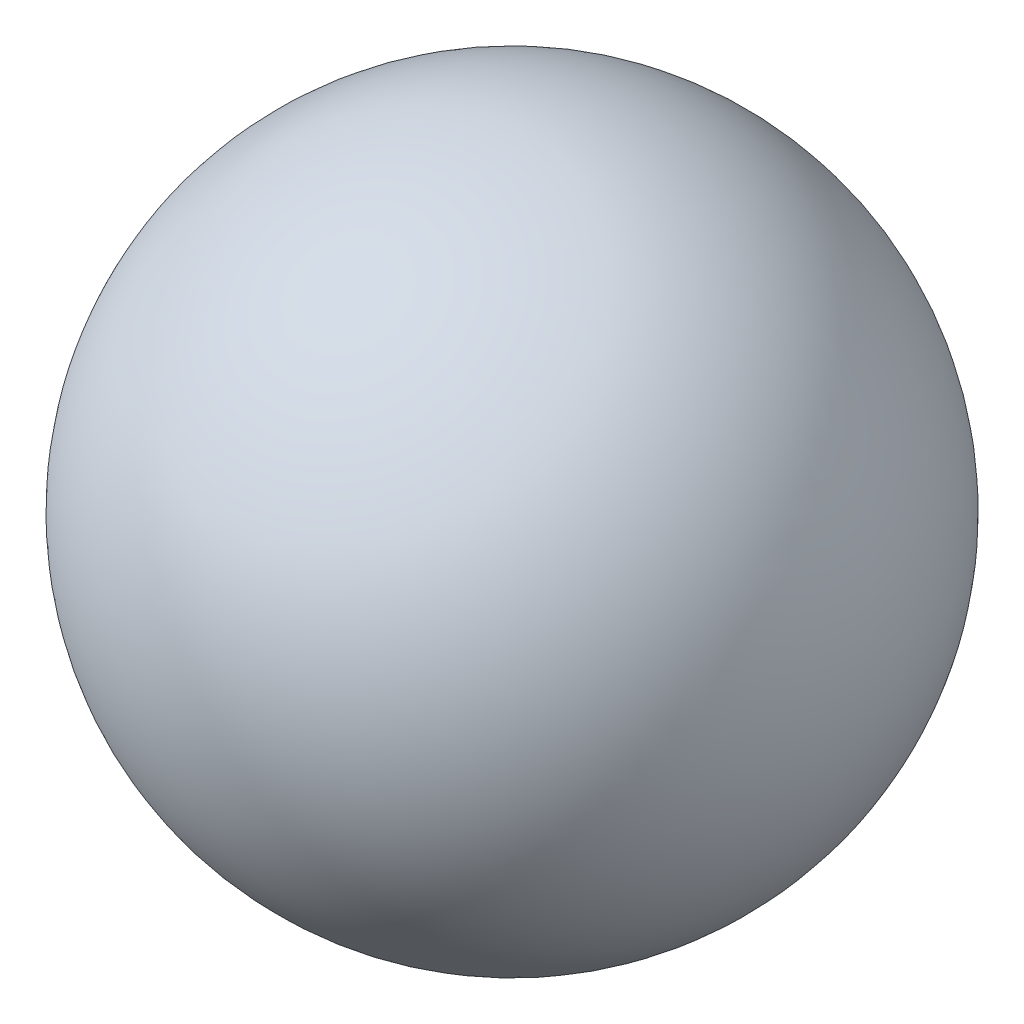
ISO-10303-21;
HEADER;
FILE_DESCRIPTION(('STEP AP214'),'2;1');
FILE_NAME('part.step','',(''),(''),'','','');
FILE_SCHEMA(('AUTOMOTIVE_DESIGN { 1 0 10303 214 1 1 1 1 }'));
ENDSEC;
DATA;
#1=APPLICATION_CONTEXT('core data for automotive mechanical design processes');
#2=APPLICATION_PROTOCOL_DEFINITION('international standard','automotive_design',2000,#1);
#3=PRODUCT_CONTEXT('',#1,'mechanical');
#4=PRODUCT('Part','Part','',(#3));
#5=PRODUCT_RELATED_PRODUCT_CATEGORY('part','',(#4));
#6=PRODUCT_DEFINITION_FORMATION('','',#4);
#7=PRODUCT_DEFINITION_CONTEXT('part definition',#1,'design');
#8=PRODUCT_DEFINITION('design','',#6,#7);
#9=PRODUCT_DEFINITION_SHAPE('','',#8);
#10=(LENGTH_UNIT() NAMED_UNIT(*) SI_UNIT(.MILLI.,.METRE.));
#11=(NAMED_UNIT(*) PLANE_ANGLE_UNIT() SI_UNIT($,.RADIAN.));
#12=(NAMED_UNIT(*) SI_UNIT($,.STERADIAN.) SOLID_ANGLE_UNIT());
#13=UNCERTAINTY_MEASURE_WITH_UNIT(LENGTH_MEASURE(1.E-05),#10,'distance_accuracy_value','');
#14=(GEOMETRIC_REPRESENTATION_CONTEXT(3) GLOBAL_UNCERTAINTY_ASSIGNED_CONTEXT((#13)) GLOBAL_UNIT_ASSIGNED_CONTEXT((#10,
#11,#12)) REPRESENTATION_CONTEXT('',''));
#15=CARTESIAN_POINT('',(0.,0.,0.));
#16=DIRECTION('',(0.,0.,1.));
#17=DIRECTION('',(1.,0.,0.));
#18=AXIS2_PLACEMENT_3D('',#15,#16,#17);
#19=CARTESIAN_POINT('',(0.,0.,0.));
#20=DIRECTION('',(1.,0.,0.));
#21=DIRECTION('',(0.,-1.,0.));
#22=AXIS2_PLACEMENT_3D('',#19,#20,#21);
#23=SPHERICAL_SURFACE('',#22,22.225);
#24=CARTESIAN_POINT('',(22.225,0.,0.));
#25=VERTEX_POINT('',#24);
#26=VERTEX_LOOP('',#25);
#27=FACE_BOUND('',#26,.T.);
#28=ADVANCED_FACE('F33',(#27),#23,.T.);
#29=CLOSED_SHELL('',(#28));
#30=MANIFOLD_SOLID_BREP('B2',#29);
#31=ADVANCED_BREP_SHAPE_REPRESENTATION('',(#18,#30),#14);
#32=SHAPE_DEFINITION_REPRESENTATION(#9,#31);
ENDSEC;
END-ISO-10303-21;
